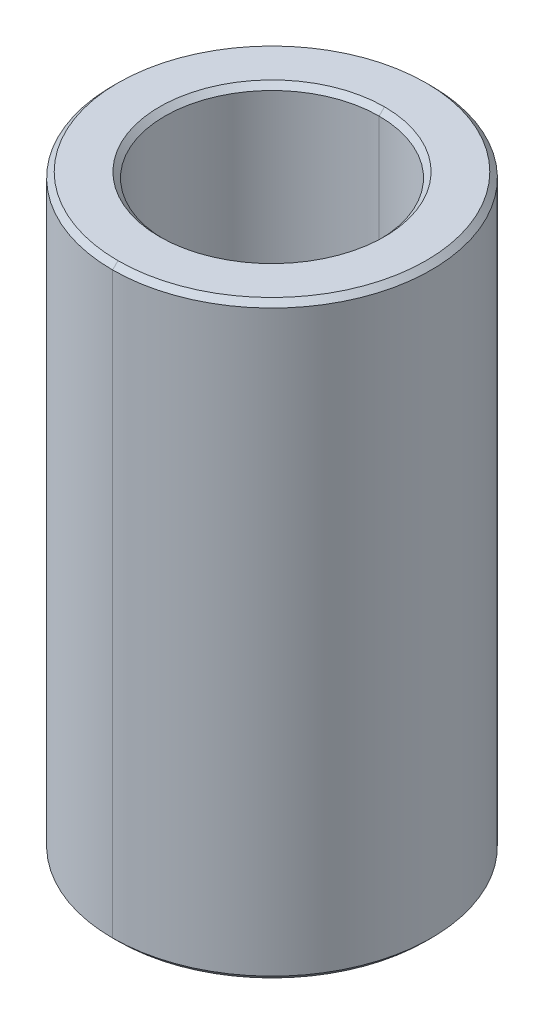
ISO-10303-21;
HEADER;
FILE_DESCRIPTION(('STEP AP214'),'2;1');
FILE_NAME('part.step','',(''),(''),'','','');
FILE_SCHEMA(('AUTOMOTIVE_DESIGN { 1 0 10303 214 1 1 1 1 }'));
ENDSEC;
DATA;
#1=APPLICATION_CONTEXT('core data for automotive mechanical design processes');
#2=APPLICATION_PROTOCOL_DEFINITION('international standard','automotive_design',2000,#1);
#3=PRODUCT_CONTEXT('',#1,'mechanical');
#4=PRODUCT('Part','Part','',(#3));
#5=PRODUCT_RELATED_PRODUCT_CATEGORY('part','',(#4));
#6=PRODUCT_DEFINITION_FORMATION('','',#4);
#7=PRODUCT_DEFINITION_CONTEXT('part definition',#1,'design');
#8=PRODUCT_DEFINITION('design','',#6,#7);
#9=PRODUCT_DEFINITION_SHAPE('','',#8);
#10=(LENGTH_UNIT() NAMED_UNIT(*) SI_UNIT(.MILLI.,.METRE.));
#11=(NAMED_UNIT(*) PLANE_ANGLE_UNIT() SI_UNIT($,.RADIAN.));
#12=(NAMED_UNIT(*) SI_UNIT($,.STERADIAN.) SOLID_ANGLE_UNIT());
#13=UNCERTAINTY_MEASURE_WITH_UNIT(LENGTH_MEASURE(1.E-05),#10,'distance_accuracy_value','');
#14=(GEOMETRIC_REPRESENTATION_CONTEXT(3) GLOBAL_UNCERTAINTY_ASSIGNED_CONTEXT((#13)) GLOBAL_UNIT_ASSIGNED_CONTEXT((#10,
#11,#12)) REPRESENTATION_CONTEXT('',''));
#15=CARTESIAN_POINT('',(0.,0.,0.));
#16=DIRECTION('',(0.,0.,1.));
#17=DIRECTION('',(1.,0.,0.));
#18=AXIS2_PLACEMENT_3D('',#15,#16,#17);
#19=CARTESIAN_POINT('',(0.,5.4,0.));
#20=DIRECTION('',(0.,1.,0.));
#21=DIRECTION('',(0.,0.,1.));
#22=AXIS2_PLACEMENT_3D('',#19,#20,#21);
#23=CONICAL_SURFACE('',#22,2.,0.78539816339744);
#24=DIRECTION('',(0.,0.707106781186554,-0.707106781186542));
#25=VECTOR('',#24,1.);
#26=CARTESIAN_POINT('',(0.,5.4,-2.));
#27=LINE('',#26,#25);
#28=CARTESIAN_POINT('',(0.,5.4,-2.));
#29=VERTEX_POINT('',#28);
#30=CARTESIAN_POINT('',(0.,5.5,-2.1));
#31=VERTEX_POINT('',#30);
#32=EDGE_CURVE('E18',#29,#31,#27,.T.);
#33=ORIENTED_EDGE('',*,*,#32,.F.);
#34=CARTESIAN_POINT('',(0.,5.4,0.));
#35=DIRECTION('',(0.,1.,0.));
#36=DIRECTION('',(0.,0.,1.));
#37=AXIS2_PLACEMENT_3D('',#34,#35,#36);
#38=CIRCLE('',#37,2.);
#39=CARTESIAN_POINT('',(0.,5.4,2.));
#40=VERTEX_POINT('',#39);
#41=EDGE_CURVE('E25',#40,#29,#38,.T.);
#42=ORIENTED_EDGE('',*,*,#41,.F.);
#43=DIRECTION('',(0.,0.707106781186554,0.707106781186542));
#44=VECTOR('',#43,1.);
#45=CARTESIAN_POINT('',(0.,5.4,2.));
#46=LINE('',#45,#44);
#47=CARTESIAN_POINT('',(0.,5.5,2.1));
#48=VERTEX_POINT('',#47);
#49=EDGE_CURVE('E157',#40,#48,#46,.T.);
#50=ORIENTED_EDGE('',*,*,#49,.T.);
#51=CARTESIAN_POINT('',(0.,5.5,0.));
#52=DIRECTION('',(0.,-1.,0.));
#53=DIRECTION('',(0.,0.,1.));
#54=AXIS2_PLACEMENT_3D('',#51,#52,#53);
#55=CIRCLE('',#54,2.1);
#56=EDGE_CURVE('E99',#31,#48,#55,.T.);
#57=ORIENTED_EDGE('',*,*,#56,.F.);
#58=EDGE_LOOP('',(#33,#42,#50,#57));
#59=FACE_BOUND('',#58,.T.);
#60=ADVANCED_FACE('F14',(#59),#23,.F.);
#61=CARTESIAN_POINT('',(0.,-5.5,0.));
#62=DIRECTION('',(0.,-1.,0.));
#63=DIRECTION('',(0.,0.,-1.));
#64=AXIS2_PLACEMENT_3D('',#61,#62,#63);
#65=CONICAL_SURFACE('',#64,2.1,0.785398163397452);
#66=DIRECTION('',(0.,-0.707106781186545,0.707106781186551));
#67=VECTOR('',#66,1.);
#68=CARTESIAN_POINT('',(0.,-5.5,2.1));
#69=LINE('',#68,#67);
#70=CARTESIAN_POINT('',(0.,-5.4,2.));
#71=VERTEX_POINT('',#70);
#72=CARTESIAN_POINT('',(0.,-5.5,2.1));
#73=VERTEX_POINT('',#72);
#74=EDGE_CURVE('E151',#71,#73,#69,.T.);
#75=ORIENTED_EDGE('',*,*,#74,.F.);
#76=CARTESIAN_POINT('',(0.,-5.4,0.));
#77=DIRECTION('',(0.,-1.,0.));
#78=DIRECTION('',(0.,0.,1.));
#79=AXIS2_PLACEMENT_3D('',#76,#77,#78);
#80=CIRCLE('',#79,2.);
#81=CARTESIAN_POINT('',(0.,-5.4,-2.));
#82=VERTEX_POINT('',#81);
#83=EDGE_CURVE('E9',#82,#71,#80,.T.);
#84=ORIENTED_EDGE('',*,*,#83,.F.);
#85=DIRECTION('',(0.,-0.707106781186545,-0.707106781186551));
#86=VECTOR('',#85,1.);
#87=CARTESIAN_POINT('',(0.,-5.5,-2.1));
#88=LINE('',#87,#86);
#89=CARTESIAN_POINT('',(0.,-5.5,-2.1));
#90=VERTEX_POINT('',#89);
#91=EDGE_CURVE('E165',#82,#90,#88,.T.);
#92=ORIENTED_EDGE('',*,*,#91,.T.);
#93=CARTESIAN_POINT('',(0.,-5.5,0.));
#94=DIRECTION('',(0.,1.,0.));
#95=DIRECTION('',(0.,0.,1.));
#96=AXIS2_PLACEMENT_3D('',#93,#94,#95);
#97=CIRCLE('',#96,2.1);
#98=EDGE_CURVE('E98',#73,#90,#97,.T.);
#99=ORIENTED_EDGE('',*,*,#98,.F.);
#100=EDGE_LOOP('',(#75,#84,#92,#99));
#101=FACE_BOUND('',#100,.T.);
#102=ADVANCED_FACE('F209',(#101),#65,.F.);
#103=CARTESIAN_POINT('',(0.,5.5,0.));
#104=DIRECTION('',(0.,-1.,0.));
#105=DIRECTION('',(0.,0.,-1.));
#106=AXIS2_PLACEMENT_3D('',#103,#104,#105);
#107=CONICAL_SURFACE('',#106,2.875,0.785398163397452);
#108=DIRECTION('',(0.,-0.707106781186545,0.707106781186551));
#109=VECTOR('',#108,1.);
#110=CARTESIAN_POINT('',(0.,5.5,2.875));
#111=LINE('',#110,#109);
#112=CARTESIAN_POINT('',(0.,5.5,2.875));
#113=VERTEX_POINT('',#112);
#114=CARTESIAN_POINT('',(0.,5.4,2.975));
#115=VERTEX_POINT('',#114);
#116=EDGE_CURVE('E172',#113,#115,#111,.T.);
#117=ORIENTED_EDGE('',*,*,#116,.F.);
#118=CARTESIAN_POINT('',(0.,5.5,0.));
#119=DIRECTION('',(0.,1.,0.));
#120=DIRECTION('',(0.,0.,1.));
#121=AXIS2_PLACEMENT_3D('',#118,#119,#120);
#122=CIRCLE('',#121,2.875);
#123=CARTESIAN_POINT('',(0.,5.5,-2.875));
#124=VERTEX_POINT('',#123);
#125=EDGE_CURVE('E67',#124,#113,#122,.T.);
#126=ORIENTED_EDGE('',*,*,#125,.F.);
#127=DIRECTION('',(0.,-0.707106781186545,-0.707106781186551));
#128=VECTOR('',#127,1.);
#129=CARTESIAN_POINT('',(0.,5.5,-2.875));
#130=LINE('',#129,#128);
#131=CARTESIAN_POINT('',(0.,5.4,-2.975));
#132=VERTEX_POINT('',#131);
#133=EDGE_CURVE('E112',#124,#132,#130,.T.);
#134=ORIENTED_EDGE('',*,*,#133,.T.);
#135=CARTESIAN_POINT('',(0.,5.4,0.));
#136=DIRECTION('',(0.,-1.,0.));
#137=DIRECTION('',(0.,0.,1.));
#138=AXIS2_PLACEMENT_3D('',#135,#136,#137);
#139=CIRCLE('',#138,2.975);
#140=EDGE_CURVE('E57',#115,#132,#139,.T.);
#141=ORIENTED_EDGE('',*,*,#140,.F.);
#142=EDGE_LOOP('',(#117,#126,#134,#141));
#143=FACE_BOUND('',#142,.T.);
#144=ADVANCED_FACE('F358',(#143),#107,.T.);
#145=CARTESIAN_POINT('',(0.,-5.4,0.));
#146=DIRECTION('',(0.,1.,0.));
#147=DIRECTION('',(0.,0.,1.));
#148=AXIS2_PLACEMENT_3D('',#145,#146,#147);
#149=CONICAL_SURFACE('',#148,2.975,0.78539816339744);
#150=DIRECTION('',(0.,0.707106781186554,-0.707106781186542));
#151=VECTOR('',#150,1.);
#152=CARTESIAN_POINT('',(0.,-5.4,-2.975));
#153=LINE('',#152,#151);
#154=CARTESIAN_POINT('',(0.,-5.5,-2.875));
#155=VERTEX_POINT('',#154);
#156=CARTESIAN_POINT('',(0.,-5.4,-2.975));
#157=VERTEX_POINT('',#156);
#158=EDGE_CURVE('E102',#155,#157,#153,.T.);
#159=ORIENTED_EDGE('',*,*,#158,.F.);
#160=CARTESIAN_POINT('',(0.,-5.5,0.));
#161=DIRECTION('',(0.,-1.,0.));
#162=DIRECTION('',(0.,0.,1.));
#163=AXIS2_PLACEMENT_3D('',#160,#161,#162);
#164=CIRCLE('',#163,2.875);
#165=CARTESIAN_POINT('',(0.,-5.5,2.875));
#166=VERTEX_POINT('',#165);
#167=EDGE_CURVE('E89',#166,#155,#164,.T.);
#168=ORIENTED_EDGE('',*,*,#167,.F.);
#169=DIRECTION('',(0.,0.707106781186554,0.707106781186542));
#170=VECTOR('',#169,1.);
#171=CARTESIAN_POINT('',(0.,-5.4,2.975));
#172=LINE('',#171,#170);
#173=CARTESIAN_POINT('',(0.,-5.4,2.975));
#174=VERTEX_POINT('',#173);
#175=EDGE_CURVE('E110',#166,#174,#172,.T.);
#176=ORIENTED_EDGE('',*,*,#175,.T.);
#177=CARTESIAN_POINT('',(0.,-5.4,0.));
#178=DIRECTION('',(0.,1.,0.));
#179=DIRECTION('',(0.,0.,1.));
#180=AXIS2_PLACEMENT_3D('',#177,#178,#179);
#181=CIRCLE('',#180,2.975);
#182=EDGE_CURVE('E39',#157,#174,#181,.T.);
#183=ORIENTED_EDGE('',*,*,#182,.F.);
#184=EDGE_LOOP('',(#159,#168,#176,#183));
#185=FACE_BOUND('',#184,.T.);
#186=ADVANCED_FACE('F103',(#185),#149,.T.);
#187=CARTESIAN_POINT('',(0.,5.5,0.));
#188=DIRECTION('',(0.,-1.,0.));
#189=DIRECTION('',(0.,0.,-1.));
#190=AXIS2_PLACEMENT_3D('',#187,#188,#189);
#191=CYLINDRICAL_SURFACE('',#190,2.);
#192=DIRECTION('',(0.,-1.,0.));
#193=VECTOR('',#192,1.);
#194=CARTESIAN_POINT('',(0.,5.5,2.));
#195=LINE('',#194,#193);
#196=EDGE_CURVE('E132',#40,#71,#195,.T.);
#197=ORIENTED_EDGE('',*,*,#196,.F.);
#198=ORIENTED_EDGE('',*,*,#41,.T.);
#199=DIRECTION('',(0.,-1.,0.));
#200=VECTOR('',#199,1.);
#201=CARTESIAN_POINT('',(0.,5.5,-2.));
#202=LINE('',#201,#200);
#203=EDGE_CURVE('E127',#29,#82,#202,.T.);
#204=ORIENTED_EDGE('',*,*,#203,.T.);
#205=ORIENTED_EDGE('',*,*,#83,.T.);
#206=EDGE_LOOP('',(#197,#198,#204,#205));
#207=FACE_BOUND('',#206,.T.);
#208=ADVANCED_FACE('F230',(#207),#191,.F.);
#209=CARTESIAN_POINT('',(0.,5.5,0.));
#210=DIRECTION('',(0.,-1.,0.));
#211=DIRECTION('',(0.,0.,-1.));
#212=AXIS2_PLACEMENT_3D('',#209,#210,#211);
#213=CYLINDRICAL_SURFACE('',#212,2.975);
#214=DIRECTION('',(0.,-1.,0.));
#215=VECTOR('',#214,1.);
#216=CARTESIAN_POINT('',(0.,5.5,2.975));
#217=LINE('',#216,#215);
#218=EDGE_CURVE('E131',#115,#174,#217,.T.);
#219=ORIENTED_EDGE('',*,*,#218,.F.);
#220=ORIENTED_EDGE('',*,*,#140,.T.);
#221=DIRECTION('',(0.,-1.,0.));
#222=VECTOR('',#221,1.);
#223=CARTESIAN_POINT('',(0.,5.5,-2.975));
#224=LINE('',#223,#222);
#225=EDGE_CURVE('E138',#132,#157,#224,.T.);
#226=ORIENTED_EDGE('',*,*,#225,.T.);
#227=ORIENTED_EDGE('',*,*,#182,.T.);
#228=EDGE_LOOP('',(#219,#220,#226,#227));
#229=FACE_BOUND('',#228,.T.);
#230=ADVANCED_FACE('F339',(#229),#213,.T.);
#231=CARTESIAN_POINT('',(0.,-5.5,0.));
#232=DIRECTION('',(0.,1.,0.));
#233=DIRECTION('',(1.,0.,0.));
#234=AXIS2_PLACEMENT_3D('',#231,#232,#233);
#235=PLANE('',#234);
#236=CARTESIAN_POINT('',(0.,-5.5,0.));
#237=DIRECTION('',(0.,1.,0.));
#238=DIRECTION('',(0.,0.,1.));
#239=AXIS2_PLACEMENT_3D('',#236,#237,#238);
#240=CIRCLE('',#239,2.1);
#241=EDGE_CURVE('E155',#90,#73,#240,.T.);
#242=ORIENTED_EDGE('',*,*,#241,.T.);
#243=ORIENTED_EDGE('',*,*,#98,.T.);
#244=EDGE_LOOP('',(#242,#243));
#245=FACE_BOUND('',#244,.T.);
#246=ORIENTED_EDGE('',*,*,#167,.T.);
#247=CARTESIAN_POINT('',(0.,-5.5,0.));
#248=DIRECTION('',(0.,-1.,0.));
#249=DIRECTION('',(0.,0.,1.));
#250=AXIS2_PLACEMENT_3D('',#247,#248,#249);
#251=CIRCLE('',#250,2.875);
#252=EDGE_CURVE('E93',#155,#166,#251,.T.);
#253=ORIENTED_EDGE('',*,*,#252,.T.);
#254=EDGE_LOOP('',(#246,#253));
#255=FACE_BOUND('',#254,.T.);
#256=ADVANCED_FACE('F91',(#245,#255),#235,.F.);
#257=CARTESIAN_POINT('',(0.,5.5,0.));
#258=DIRECTION('',(0.,1.,0.));
#259=DIRECTION('',(1.,0.,0.));
#260=AXIS2_PLACEMENT_3D('',#257,#258,#259);
#261=PLANE('',#260);
#262=CARTESIAN_POINT('',(0.,5.5,0.));
#263=DIRECTION('',(0.,-1.,0.));
#264=DIRECTION('',(0.,0.,1.));
#265=AXIS2_PLACEMENT_3D('',#262,#263,#264);
#266=CIRCLE('',#265,2.1);
#267=EDGE_CURVE('E123',#48,#31,#266,.T.);
#268=ORIENTED_EDGE('',*,*,#267,.T.);
#269=ORIENTED_EDGE('',*,*,#56,.T.);
#270=EDGE_LOOP('',(#268,#269));
#271=FACE_BOUND('',#270,.T.);
#272=ORIENTED_EDGE('',*,*,#125,.T.);
#273=CARTESIAN_POINT('',(0.,5.5,0.));
#274=DIRECTION('',(0.,1.,0.));
#275=DIRECTION('',(0.,0.,1.));
#276=AXIS2_PLACEMENT_3D('',#273,#274,#275);
#277=CIRCLE('',#276,2.875);
#278=EDGE_CURVE('E169',#113,#124,#277,.T.);
#279=ORIENTED_EDGE('',*,*,#278,.T.);
#280=EDGE_LOOP('',(#272,#279));
#281=FACE_BOUND('',#280,.T.);
#282=ADVANCED_FACE('F370',(#271,#281),#261,.T.);
#283=CARTESIAN_POINT('',(0.,5.5,0.));
#284=DIRECTION('',(0.,-1.,0.));
#285=DIRECTION('',(0.,0.,-1.));
#286=AXIS2_PLACEMENT_3D('',#283,#284,#285);
#287=CYLINDRICAL_SURFACE('',#286,2.975);
#288=CARTESIAN_POINT('',(0.,5.4,0.));
#289=DIRECTION('',(0.,-1.,0.));
#290=DIRECTION('',(0.,0.,1.));
#291=AXIS2_PLACEMENT_3D('',#288,#289,#290);
#292=CIRCLE('',#291,2.975);
#293=EDGE_CURVE('E119',#132,#115,#292,.T.);
#294=ORIENTED_EDGE('',*,*,#293,.T.);
#295=ORIENTED_EDGE('',*,*,#218,.T.);
#296=CARTESIAN_POINT('',(0.,-5.4,0.));
#297=DIRECTION('',(0.,1.,0.));
#298=DIRECTION('',(0.,0.,1.));
#299=AXIS2_PLACEMENT_3D('',#296,#297,#298);
#300=CIRCLE('',#299,2.975);
#301=EDGE_CURVE('E107',#174,#157,#300,.T.);
#302=ORIENTED_EDGE('',*,*,#301,.T.);
#303=ORIENTED_EDGE('',*,*,#225,.F.);
#304=EDGE_LOOP('',(#294,#295,#302,#303));
#305=FACE_BOUND('',#304,.T.);
#306=ADVANCED_FACE('F16',(#305),#287,.T.);
#307=CARTESIAN_POINT('',(0.,5.5,0.));
#308=DIRECTION('',(0.,-1.,0.));
#309=DIRECTION('',(0.,0.,-1.));
#310=AXIS2_PLACEMENT_3D('',#307,#308,#309);
#311=CYLINDRICAL_SURFACE('',#310,2.);
#312=CARTESIAN_POINT('',(0.,5.4,0.));
#313=DIRECTION('',(0.,1.,0.));
#314=DIRECTION('',(0.,0.,1.));
#315=AXIS2_PLACEMENT_3D('',#312,#313,#314);
#316=CIRCLE('',#315,2.);
#317=EDGE_CURVE('E238',#29,#40,#316,.T.);
#318=ORIENTED_EDGE('',*,*,#317,.T.);
#319=ORIENTED_EDGE('',*,*,#196,.T.);
#320=CARTESIAN_POINT('',(0.,-5.4,0.));
#321=DIRECTION('',(0.,-1.,0.));
#322=DIRECTION('',(0.,0.,1.));
#323=AXIS2_PLACEMENT_3D('',#320,#321,#322);
#324=CIRCLE('',#323,2.);
#325=EDGE_CURVE('E156',#71,#82,#324,.T.);
#326=ORIENTED_EDGE('',*,*,#325,.T.);
#327=ORIENTED_EDGE('',*,*,#203,.F.);
#328=EDGE_LOOP('',(#318,#319,#326,#327));
#329=FACE_BOUND('',#328,.T.);
#330=ADVANCED_FACE('F236',(#329),#311,.F.);
#331=CARTESIAN_POINT('',(0.,-5.4,0.));
#332=DIRECTION('',(0.,1.,0.));
#333=DIRECTION('',(0.,0.,1.));
#334=AXIS2_PLACEMENT_3D('',#331,#332,#333);
#335=CONICAL_SURFACE('',#334,2.975,0.78539816339744);
#336=ORIENTED_EDGE('',*,*,#252,.F.);
#337=ORIENTED_EDGE('',*,*,#158,.T.);
#338=ORIENTED_EDGE('',*,*,#301,.F.);
#339=ORIENTED_EDGE('',*,*,#175,.F.);
#340=EDGE_LOOP('',(#336,#337,#338,#339));
#341=FACE_BOUND('',#340,.T.);
#342=ADVANCED_FACE('F109',(#341),#335,.T.);
#343=CARTESIAN_POINT('',(0.,5.5,0.));
#344=DIRECTION('',(0.,-1.,0.));
#345=DIRECTION('',(0.,0.,-1.));
#346=AXIS2_PLACEMENT_3D('',#343,#344,#345);
#347=CONICAL_SURFACE('',#346,2.875,0.785398163397452);
#348=ORIENTED_EDGE('',*,*,#278,.F.);
#349=ORIENTED_EDGE('',*,*,#116,.T.);
#350=ORIENTED_EDGE('',*,*,#293,.F.);
#351=ORIENTED_EDGE('',*,*,#133,.F.);
#352=EDGE_LOOP('',(#348,#349,#350,#351));
#353=FACE_BOUND('',#352,.T.);
#354=ADVANCED_FACE('F350',(#353),#347,.T.);
#355=CARTESIAN_POINT('',(0.,-5.5,0.));
#356=DIRECTION('',(0.,-1.,0.));
#357=DIRECTION('',(0.,0.,-1.));
#358=AXIS2_PLACEMENT_3D('',#355,#356,#357);
#359=CONICAL_SURFACE('',#358,2.1,0.785398163397452);
#360=ORIENTED_EDGE('',*,*,#325,.F.);
#361=ORIENTED_EDGE('',*,*,#74,.T.);
#362=ORIENTED_EDGE('',*,*,#241,.F.);
#363=ORIENTED_EDGE('',*,*,#91,.F.);
#364=EDGE_LOOP('',(#360,#361,#362,#363));
#365=FACE_BOUND('',#364,.T.);
#366=ADVANCED_FACE('F205',(#365),#359,.F.);
#367=CARTESIAN_POINT('',(0.,5.4,0.));
#368=DIRECTION('',(0.,1.,0.));
#369=DIRECTION('',(0.,0.,1.));
#370=AXIS2_PLACEMENT_3D('',#367,#368,#369);
#371=CONICAL_SURFACE('',#370,2.,0.78539816339744);
#372=ORIENTED_EDGE('',*,*,#317,.F.);
#373=ORIENTED_EDGE('',*,*,#32,.T.);
#374=ORIENTED_EDGE('',*,*,#267,.F.);
#375=ORIENTED_EDGE('',*,*,#49,.F.);
#376=EDGE_LOOP('',(#372,#373,#374,#375));
#377=FACE_BOUND('',#376,.T.);
#378=ADVANCED_FACE('F245',(#377),#371,.F.);
#379=CLOSED_SHELL('',(#60,#102,#144,#186,#208,#230,#256,#282,#306,#330,#342,#354,#366,#378));
#380=MANIFOLD_SOLID_BREP('B1',#379);
#381=ADVANCED_BREP_SHAPE_REPRESENTATION('',(#18,#380),#14);
#382=SHAPE_DEFINITION_REPRESENTATION(#9,#381);
ENDSEC;
END-ISO-10303-21;
